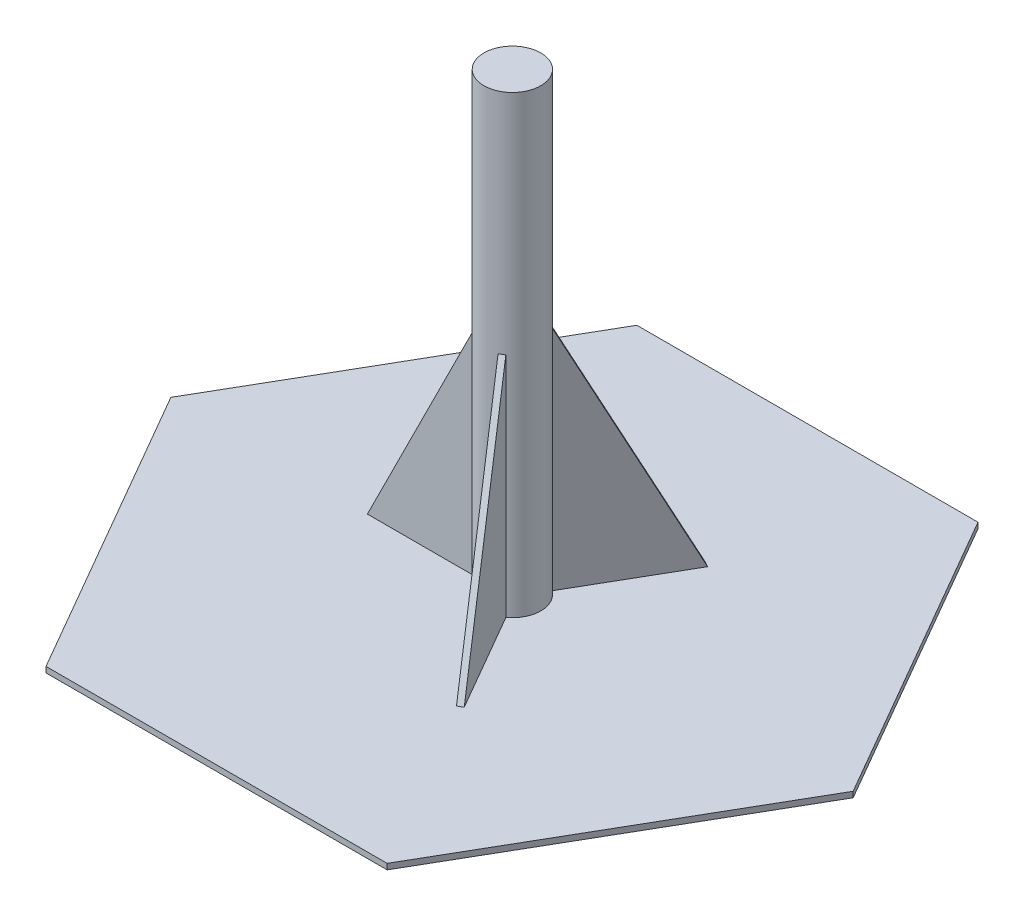
ISO-10303-21;
HEADER;
FILE_DESCRIPTION(('STEP AP214'),'2;1');
FILE_NAME('part.step','',(''),(''),'','','');
FILE_SCHEMA(('AUTOMOTIVE_DESIGN { 1 0 10303 214 1 1 1 1 }'));
ENDSEC;
DATA;
#1=APPLICATION_CONTEXT('core data for automotive mechanical design processes');
#2=APPLICATION_PROTOCOL_DEFINITION('international standard','automotive_design',2000,#1);
#3=PRODUCT_CONTEXT('',#1,'mechanical');
#4=PRODUCT('Part','Part','',(#3));
#5=PRODUCT_RELATED_PRODUCT_CATEGORY('part','',(#4));
#6=PRODUCT_DEFINITION_FORMATION('','',#4);
#7=PRODUCT_DEFINITION_CONTEXT('part definition',#1,'design');
#8=PRODUCT_DEFINITION('design','',#6,#7);
#9=PRODUCT_DEFINITION_SHAPE('','',#8);
#10=(LENGTH_UNIT() NAMED_UNIT(*) SI_UNIT(.MILLI.,.METRE.));
#11=(NAMED_UNIT(*) PLANE_ANGLE_UNIT() SI_UNIT($,.RADIAN.));
#12=(NAMED_UNIT(*) SI_UNIT($,.STERADIAN.) SOLID_ANGLE_UNIT());
#13=UNCERTAINTY_MEASURE_WITH_UNIT(LENGTH_MEASURE(1.E-05),#10,'distance_accuracy_value','');
#14=(GEOMETRIC_REPRESENTATION_CONTEXT(3) GLOBAL_UNCERTAINTY_ASSIGNED_CONTEXT((#13)) GLOBAL_UNIT_ASSIGNED_CONTEXT((#10,
#11,#12)) REPRESENTATION_CONTEXT('',''));
#15=CARTESIAN_POINT('',(0.,0.,0.));
#16=DIRECTION('',(0.,0.,1.));
#17=DIRECTION('',(1.,0.,0.));
#18=AXIS2_PLACEMENT_3D('',#15,#16,#17);
#19=CARTESIAN_POINT('',(5.25014773719376,104.14,-11.6335226280624));
#20=DIRECTION('',(-0.447213595499958,-0.447213595499958,0.774596669241483));
#21=DIRECTION('',(0.866025403784439,0.,0.5));
#22=AXIS2_PLACEMENT_3D('',#19,#20,#21);
#23=PLANE('',#22);
#24=DIRECTION('',(0.223606797749979,-0.894427190999916,-0.387298334620742));
#25=VECTOR('',#24,1.);
#26=CARTESIAN_POINT('',(7.44985226280624,104.14,-10.3635226280624));
#27=LINE('',#26,#25);
#28=CARTESIAN_POINT('',(7.44985226280624,104.14,-10.3635226280624));
#29=VERTEX_POINT('',#28);
#30=CARTESIAN_POINT('',(32.8498522628062,2.53999999999999,-54.3576131403118));
#31=VERTEX_POINT('',#30);
#32=EDGE_CURVE('E99',#29,#31,#27,.T.);
#33=ORIENTED_EDGE('',*,*,#32,.T.);
#34=DIRECTION('',(0.866025403784439,0.,0.5));
#35=VECTOR('',#34,1.);
#36=CARTESIAN_POINT('',(30.6501477371938,2.53999999999999,-55.6276131403118));
#37=LINE('',#36,#35);
#38=CARTESIAN_POINT('',(30.6501477371938,2.53999999999999,-55.6276131403118));
#39=VERTEX_POINT('',#38);
#40=EDGE_CURVE('E13',#39,#31,#37,.T.);
#41=ORIENTED_EDGE('',*,*,#40,.F.);
#42=DIRECTION('',(0.223606797749979,-0.894427190999916,-0.387298334620742));
#43=VECTOR('',#42,1.);
#44=CARTESIAN_POINT('',(5.25014773719376,104.14,-11.6335226280624));
#45=LINE('',#44,#43);
#46=CARTESIAN_POINT('',(5.25014773719376,104.14,-11.6335226280624));
#47=VERTEX_POINT('',#46);
#48=EDGE_CURVE('E92',#47,#39,#45,.T.);
#49=ORIENTED_EDGE('',*,*,#48,.F.);
#50=DIRECTION('',(0.866025403784439,0.,0.5));
#51=VECTOR('',#50,1.);
#52=CARTESIAN_POINT('',(5.25014773719376,104.14,-11.6335226280624));
#53=LINE('',#52,#51);
#54=EDGE_CURVE('E100',#47,#29,#53,.T.);
#55=ORIENTED_EDGE('',*,*,#54,.T.);
#56=EDGE_LOOP('',(#33,#41,#49,#55));
#57=FACE_BOUND('',#56,.T.);
#58=ADVANCED_FACE('F52',(#57),#23,.F.);
#59=CARTESIAN_POINT('',(5.25014773719376,2.53999999999999,-11.6335226280624));
#60=DIRECTION('',(0.,1.,0.));
#61=DIRECTION('',(0.,0.,1.));
#62=AXIS2_PLACEMENT_3D('',#59,#60,#61);
#63=PLANE('',#62);
#64=DIRECTION('',(-0.5,0.,0.866025403784439));
#65=VECTOR('',#64,1.);
#66=CARTESIAN_POINT('',(7.44985226280624,2.53999999999999,-10.3635226280624));
#67=LINE('',#66,#65);
#68=CARTESIAN_POINT('',(7.44985226280624,2.53999999999999,-10.3635226280624));
#69=VERTEX_POINT('',#68);
#70=EDGE_CURVE('E80',#31,#69,#67,.T.);
#71=ORIENTED_EDGE('',*,*,#70,.T.);
#72=DIRECTION('',(0.866025403784439,0.,0.5));
#73=VECTOR('',#72,1.);
#74=CARTESIAN_POINT('',(5.25014773719376,2.53999999999999,-11.6335226280624));
#75=LINE('',#74,#73);
#76=CARTESIAN_POINT('',(5.25014773719376,2.53999999999999,-11.6335226280624));
#77=VERTEX_POINT('',#76);
#78=EDGE_CURVE('E60',#77,#69,#75,.T.);
#79=ORIENTED_EDGE('',*,*,#78,.F.);
#80=DIRECTION('',(-0.5,0.,0.866025403784439));
#81=VECTOR('',#80,1.);
#82=CARTESIAN_POINT('',(5.25014773719376,2.53999999999999,-11.6335226280624));
#83=LINE('',#82,#81);
#84=EDGE_CURVE('E88',#39,#77,#83,.T.);
#85=ORIENTED_EDGE('',*,*,#84,.F.);
#86=ORIENTED_EDGE('',*,*,#40,.T.);
#87=EDGE_LOOP('',(#71,#79,#85,#86));
#88=FACE_BOUND('',#87,.T.);
#89=ADVANCED_FACE('F89',(#88),#63,.F.);
#90=CARTESIAN_POINT('',(5.25014773719376,2.53999999999999,-11.6335226280624));
#91=DIRECTION('',(0.5,0.,-0.866025403784439));
#92=DIRECTION('',(-0.866025403784439,0.,-0.5));
#93=AXIS2_PLACEMENT_3D('',#90,#91,#92);
#94=PLANE('',#93);
#95=DIRECTION('',(0.,1.,0.));
#96=VECTOR('',#95,1.);
#97=CARTESIAN_POINT('',(7.44985226280624,2.53999999999999,-10.3635226280624));
#98=LINE('',#97,#96);
#99=EDGE_CURVE('E85',#69,#29,#98,.T.);
#100=ORIENTED_EDGE('',*,*,#99,.T.);
#101=ORIENTED_EDGE('',*,*,#54,.F.);
#102=DIRECTION('',(0.,1.,0.));
#103=VECTOR('',#102,1.);
#104=CARTESIAN_POINT('',(5.25014773719376,2.53999999999999,-11.6335226280624));
#105=LINE('',#104,#103);
#106=EDGE_CURVE('E68',#77,#47,#105,.T.);
#107=ORIENTED_EDGE('',*,*,#106,.F.);
#108=ORIENTED_EDGE('',*,*,#78,.T.);
#109=EDGE_LOOP('',(#100,#101,#107,#108));
#110=FACE_BOUND('',#109,.T.);
#111=ADVANCED_FACE('F107',(#110),#94,.F.);
#112=CARTESIAN_POINT('',(-1.09985226280624,0.,-0.635));
#113=DIRECTION('',(0.866025403784439,0.,0.5));
#114=DIRECTION('',(0.5,0.,-0.866025403784439));
#115=AXIS2_PLACEMENT_3D('',#112,#113,#114);
#116=PLANE('',#115);
#117=ORIENTED_EDGE('',*,*,#48,.T.);
#118=ORIENTED_EDGE('',*,*,#84,.T.);
#119=ORIENTED_EDGE('',*,*,#106,.T.);
#120=EDGE_LOOP('',(#117,#118,#119));
#121=FACE_BOUND('',#120,.T.);
#122=ADVANCED_FACE('F95',(#121),#116,.F.);
#123=CARTESIAN_POINT('',(1.09985226280624,0.,0.635));
#124=DIRECTION('',(0.866025403784439,0.,0.5));
#125=DIRECTION('',(0.5,0.,-0.866025403784439));
#126=AXIS2_PLACEMENT_3D('',#123,#124,#125);
#127=PLANE('',#126);
#128=ORIENTED_EDGE('',*,*,#32,.F.);
#129=ORIENTED_EDGE('',*,*,#99,.F.);
#130=ORIENTED_EDGE('',*,*,#70,.F.);
#131=EDGE_LOOP('',(#128,#129,#130));
#132=FACE_BOUND('',#131,.T.);
#133=ADVANCED_FACE('F108',(#132),#127,.T.);
#134=CLOSED_SHELL('',(#58,#89,#111,#122,#133));
#135=MANIFOLD_SOLID_BREP('B2',#134);
#136=CARTESIAN_POINT('',(-12.7,104.14,1.27000000000001));
#137=DIRECTION('',(0.894427190999916,-0.447213595499958,0.));
#138=DIRECTION('',(0.447213595499958,0.894427190999916,0.));
#139=AXIS2_PLACEMENT_3D('',#136,#137,#138);
#140=PLANE('',#139);
#141=DIRECTION('',(-0.447213595499958,-0.894427190999916,0.));
#142=VECTOR('',#141,1.);
#143=CARTESIAN_POINT('',(-12.7,104.14,-1.26999999999999));
#144=LINE('',#143,#142);
#145=CARTESIAN_POINT('',(-12.7,104.14,-1.26999999999999));
#146=VERTEX_POINT('',#145);
#147=CARTESIAN_POINT('',(-63.5,2.53999999999999,-1.26999999999999));
#148=VERTEX_POINT('',#147);
#149=EDGE_CURVE('E206',#146,#148,#144,.T.);
#150=ORIENTED_EDGE('',*,*,#149,.T.);
#151=DIRECTION('',(0.,0.,-1.));
#152=VECTOR('',#151,1.);
#153=CARTESIAN_POINT('',(-63.5,2.53999999999999,1.27000000000001));
#154=LINE('',#153,#152);
#155=CARTESIAN_POINT('',(-63.5,2.53999999999999,1.27000000000001));
#156=VERTEX_POINT('',#155);
#157=EDGE_CURVE('E50',#156,#148,#154,.T.);
#158=ORIENTED_EDGE('',*,*,#157,.F.);
#159=DIRECTION('',(-0.447213595499958,-0.894427190999916,0.));
#160=VECTOR('',#159,1.);
#161=CARTESIAN_POINT('',(-12.7,104.14,1.27000000000001));
#162=LINE('',#161,#160);
#163=CARTESIAN_POINT('',(-12.7,104.14,1.27000000000001));
#164=VERTEX_POINT('',#163);
#165=EDGE_CURVE('E199',#164,#156,#162,.T.);
#166=ORIENTED_EDGE('',*,*,#165,.F.);
#167=DIRECTION('',(0.,0.,-1.));
#168=VECTOR('',#167,1.);
#169=CARTESIAN_POINT('',(-12.7,104.14,1.27000000000001));
#170=LINE('',#169,#168);
#171=EDGE_CURVE('E207',#164,#146,#170,.T.);
#172=ORIENTED_EDGE('',*,*,#171,.T.);
#173=EDGE_LOOP('',(#150,#158,#166,#172));
#174=FACE_BOUND('',#173,.T.);
#175=ADVANCED_FACE('F159',(#174),#140,.F.);
#176=CARTESIAN_POINT('',(-12.7,2.53999999999999,1.27000000000001));
#177=DIRECTION('',(0.,1.,0.));
#178=DIRECTION('',(0.,0.,1.));
#179=AXIS2_PLACEMENT_3D('',#176,#177,#178);
#180=PLANE('',#179);
#181=DIRECTION('',(1.,0.,0.));
#182=VECTOR('',#181,1.);
#183=CARTESIAN_POINT('',(-12.7,2.53999999999999,-1.26999999999999));
#184=LINE('',#183,#182);
#185=CARTESIAN_POINT('',(-12.7,2.53999999999999,-1.26999999999999));
#186=VERTEX_POINT('',#185);
#187=EDGE_CURVE('E187',#148,#186,#184,.T.);
#188=ORIENTED_EDGE('',*,*,#187,.T.);
#189=DIRECTION('',(0.,0.,-1.));
#190=VECTOR('',#189,1.);
#191=CARTESIAN_POINT('',(-12.7,2.53999999999999,1.27000000000001));
#192=LINE('',#191,#190);
#193=CARTESIAN_POINT('',(-12.7,2.53999999999999,1.27000000000001));
#194=VERTEX_POINT('',#193);
#195=EDGE_CURVE('E167',#194,#186,#192,.T.);
#196=ORIENTED_EDGE('',*,*,#195,.F.);
#197=DIRECTION('',(1.,0.,0.));
#198=VECTOR('',#197,1.);
#199=CARTESIAN_POINT('',(-12.7,2.53999999999999,1.27000000000001));
#200=LINE('',#199,#198);
#201=EDGE_CURVE('E195',#156,#194,#200,.T.);
#202=ORIENTED_EDGE('',*,*,#201,.F.);
#203=ORIENTED_EDGE('',*,*,#157,.T.);
#204=EDGE_LOOP('',(#188,#196,#202,#203));
#205=FACE_BOUND('',#204,.T.);
#206=ADVANCED_FACE('F196',(#205),#180,.F.);
#207=CARTESIAN_POINT('',(-12.7,2.53999999999999,1.27000000000001));
#208=DIRECTION('',(-1.,0.,0.));
#209=DIRECTION('',(0.,0.,1.));
#210=AXIS2_PLACEMENT_3D('',#207,#208,#209);
#211=PLANE('',#210);
#212=DIRECTION('',(0.,1.,0.));
#213=VECTOR('',#212,1.);
#214=CARTESIAN_POINT('',(-12.7,2.53999999999999,-1.26999999999999));
#215=LINE('',#214,#213);
#216=EDGE_CURVE('E192',#186,#146,#215,.T.);
#217=ORIENTED_EDGE('',*,*,#216,.T.);
#218=ORIENTED_EDGE('',*,*,#171,.F.);
#219=DIRECTION('',(0.,1.,0.));
#220=VECTOR('',#219,1.);
#221=CARTESIAN_POINT('',(-12.7,2.53999999999999,1.27000000000001));
#222=LINE('',#221,#220);
#223=EDGE_CURVE('E175',#194,#164,#222,.T.);
#224=ORIENTED_EDGE('',*,*,#223,.F.);
#225=ORIENTED_EDGE('',*,*,#195,.T.);
#226=EDGE_LOOP('',(#217,#218,#224,#225));
#227=FACE_BOUND('',#226,.T.);
#228=ADVANCED_FACE('F214',(#227),#211,.F.);
#229=CARTESIAN_POINT('',(0.,0.,1.27000000000001));
#230=DIRECTION('',(0.,0.,-1.));
#231=DIRECTION('',(-1.,0.,0.));
#232=AXIS2_PLACEMENT_3D('',#229,#230,#231);
#233=PLANE('',#232);
#234=ORIENTED_EDGE('',*,*,#165,.T.);
#235=ORIENTED_EDGE('',*,*,#201,.T.);
#236=ORIENTED_EDGE('',*,*,#223,.T.);
#237=EDGE_LOOP('',(#234,#235,#236));
#238=FACE_BOUND('',#237,.T.);
#239=ADVANCED_FACE('F202',(#238),#233,.F.);
#240=CARTESIAN_POINT('',(0.,0.,-1.26999999999999));
#241=DIRECTION('',(0.,0.,-1.));
#242=DIRECTION('',(-1.,0.,0.));
#243=AXIS2_PLACEMENT_3D('',#240,#241,#242);
#244=PLANE('',#243);
#245=ORIENTED_EDGE('',*,*,#149,.F.);
#246=ORIENTED_EDGE('',*,*,#216,.F.);
#247=ORIENTED_EDGE('',*,*,#187,.F.);
#248=EDGE_LOOP('',(#245,#246,#247));
#249=FACE_BOUND('',#248,.T.);
#250=ADVANCED_FACE('F215',(#249),#244,.T.);
#251=CLOSED_SHELL('',(#175,#206,#228,#239,#250));
#252=MANIFOLD_SOLID_BREP('B7',#251);
#253=CARTESIAN_POINT('',(7.44985226280624,104.14,10.3635226280624));
#254=DIRECTION('',(-0.447213595499958,-0.447213595499958,-0.774596669241483));
#255=DIRECTION('',(0.,0.866025403784439,-0.5));
#256=AXIS2_PLACEMENT_3D('',#253,#254,#255);
#257=PLANE('',#256);
#258=DIRECTION('',(0.223606797749979,-0.894427190999916,0.387298334620742));
#259=VECTOR('',#258,1.);
#260=CARTESIAN_POINT('',(5.25014773719376,104.14,11.6335226280624));
#261=LINE('',#260,#259);
#262=CARTESIAN_POINT('',(5.25014773719376,104.14,11.6335226280624));
#263=VERTEX_POINT('',#262);
#264=CARTESIAN_POINT('',(30.6501477371937,2.53999999999999,55.6276131403119));
#265=VERTEX_POINT('',#264);
#266=EDGE_CURVE('E312',#263,#265,#261,.T.);
#267=ORIENTED_EDGE('',*,*,#266,.T.);
#268=DIRECTION('',(-0.866025403784439,0.,0.5));
#269=VECTOR('',#268,1.);
#270=CARTESIAN_POINT('',(32.8498522628062,2.53999999999999,54.3576131403118));
#271=LINE('',#270,#269);
#272=CARTESIAN_POINT('',(32.8498522628062,2.53999999999999,54.3576131403118));
#273=VERTEX_POINT('',#272);
#274=EDGE_CURVE('E157',#273,#265,#271,.T.);
#275=ORIENTED_EDGE('',*,*,#274,.F.);
#276=DIRECTION('',(0.223606797749979,-0.894427190999916,0.387298334620742));
#277=VECTOR('',#276,1.);
#278=CARTESIAN_POINT('',(7.44985226280624,104.14,10.3635226280624));
#279=LINE('',#278,#277);
#280=CARTESIAN_POINT('',(7.44985226280624,104.14,10.3635226280624));
#281=VERTEX_POINT('',#280);
#282=EDGE_CURVE('E305',#281,#273,#279,.T.);
#283=ORIENTED_EDGE('',*,*,#282,.F.);
#284=DIRECTION('',(-0.866025403784439,0.,0.5));
#285=VECTOR('',#284,1.);
#286=CARTESIAN_POINT('',(7.44985226280624,104.14,10.3635226280624));
#287=LINE('',#286,#285);
#288=EDGE_CURVE('E313',#281,#263,#287,.T.);
#289=ORIENTED_EDGE('',*,*,#288,.T.);
#290=EDGE_LOOP('',(#267,#275,#283,#289));
#291=FACE_BOUND('',#290,.T.);
#292=ADVANCED_FACE('F265',(#291),#257,.F.);
#293=CARTESIAN_POINT('',(7.44985226280624,2.53999999999999,10.3635226280624));
#294=DIRECTION('',(0.,1.,0.));
#295=DIRECTION('',(0.,0.,1.));
#296=AXIS2_PLACEMENT_3D('',#293,#294,#295);
#297=PLANE('',#296);
#298=DIRECTION('',(-0.5,0.,-0.866025403784439));
#299=VECTOR('',#298,1.);
#300=CARTESIAN_POINT('',(5.25014773719376,2.53999999999999,11.6335226280624));
#301=LINE('',#300,#299);
#302=CARTESIAN_POINT('',(5.25014773719376,2.53999999999999,11.6335226280624));
#303=VERTEX_POINT('',#302);
#304=EDGE_CURVE('E293',#265,#303,#301,.T.);
#305=ORIENTED_EDGE('',*,*,#304,.T.);
#306=DIRECTION('',(-0.866025403784439,0.,0.5));
#307=VECTOR('',#306,1.);
#308=CARTESIAN_POINT('',(7.44985226280624,2.53999999999999,10.3635226280624));
#309=LINE('',#308,#307);
#310=CARTESIAN_POINT('',(7.44985226280624,2.53999999999999,10.3635226280624));
#311=VERTEX_POINT('',#310);
#312=EDGE_CURVE('E273',#311,#303,#309,.T.);
#313=ORIENTED_EDGE('',*,*,#312,.F.);
#314=DIRECTION('',(-0.5,0.,-0.866025403784439));
#315=VECTOR('',#314,1.);
#316=CARTESIAN_POINT('',(7.44985226280624,2.53999999999999,10.3635226280624));
#317=LINE('',#316,#315);
#318=EDGE_CURVE('E301',#273,#311,#317,.T.);
#319=ORIENTED_EDGE('',*,*,#318,.F.);
#320=ORIENTED_EDGE('',*,*,#274,.T.);
#321=EDGE_LOOP('',(#305,#313,#319,#320));
#322=FACE_BOUND('',#321,.T.);
#323=ADVANCED_FACE('F302',(#322),#297,.F.);
#324=CARTESIAN_POINT('',(7.44985226280624,2.53999999999999,10.3635226280624));
#325=DIRECTION('',(0.5,0.,0.866025403784439));
#326=DIRECTION('',(0.866025403784439,0.,-0.5));
#327=AXIS2_PLACEMENT_3D('',#324,#325,#326);
#328=PLANE('',#327);
#329=DIRECTION('',(0.,1.,0.));
#330=VECTOR('',#329,1.);
#331=CARTESIAN_POINT('',(5.25014773719376,2.53999999999999,11.6335226280624));
#332=LINE('',#331,#330);
#333=EDGE_CURVE('E298',#303,#263,#332,.T.);
#334=ORIENTED_EDGE('',*,*,#333,.T.);
#335=ORIENTED_EDGE('',*,*,#288,.F.);
#336=DIRECTION('',(0.,1.,0.));
#337=VECTOR('',#336,1.);
#338=CARTESIAN_POINT('',(7.44985226280624,2.53999999999999,10.3635226280624));
#339=LINE('',#338,#337);
#340=EDGE_CURVE('E281',#311,#281,#339,.T.);
#341=ORIENTED_EDGE('',*,*,#340,.F.);
#342=ORIENTED_EDGE('',*,*,#312,.T.);
#343=EDGE_LOOP('',(#334,#335,#341,#342));
#344=FACE_BOUND('',#343,.T.);
#345=ADVANCED_FACE('F320',(#344),#328,.F.);
#346=CARTESIAN_POINT('',(1.09985226280624,0.,-0.635));
#347=DIRECTION('',(-0.866025403784439,0.,0.5));
#348=DIRECTION('',(0.5,0.,0.866025403784439));
#349=AXIS2_PLACEMENT_3D('',#346,#347,#348);
#350=PLANE('',#349);
#351=ORIENTED_EDGE('',*,*,#282,.T.);
#352=ORIENTED_EDGE('',*,*,#318,.T.);
#353=ORIENTED_EDGE('',*,*,#340,.T.);
#354=EDGE_LOOP('',(#351,#352,#353));
#355=FACE_BOUND('',#354,.T.);
#356=ADVANCED_FACE('F308',(#355),#350,.F.);
#357=CARTESIAN_POINT('',(-1.09985226280624,0.,0.635));
#358=DIRECTION('',(-0.866025403784439,0.,0.5));
#359=DIRECTION('',(0.5,0.,0.866025403784439));
#360=AXIS2_PLACEMENT_3D('',#357,#358,#359);
#361=PLANE('',#360);
#362=ORIENTED_EDGE('',*,*,#266,.F.);
#363=ORIENTED_EDGE('',*,*,#333,.F.);
#364=ORIENTED_EDGE('',*,*,#304,.F.);
#365=EDGE_LOOP('',(#362,#363,#364));
#366=FACE_BOUND('',#365,.T.);
#367=ADVANCED_FACE('F321',(#366),#361,.T.);
#368=CLOSED_SHELL('',(#292,#323,#345,#356,#367));
#369=MANIFOLD_SOLID_BREP('B44',#368);
#370=CARTESIAN_POINT('',(-76.3645067291794,2.54,131.982271536748));
#371=DIRECTION('',(0.,0.,-1.));
#372=DIRECTION('',(-1.,0.,0.));
#373=AXIS2_PLACEMENT_3D('',#370,#371,#372);
#374=PLANE('',#373);
#375=DIRECTION('',(1.,0.,0.));
#376=VECTOR('',#375,1.);
#377=CARTESIAN_POINT('',(-76.3645067291794,0.,131.982271536748));
#378=LINE('',#377,#376);
#379=CARTESIAN_POINT('',(-76.3645067291794,0.,131.982271536748));
#380=VERTEX_POINT('',#379);
#381=CARTESIAN_POINT('',(76.0354932708207,0.,131.982271536748));
#382=VERTEX_POINT('',#381);
#383=EDGE_CURVE('E446',#380,#382,#378,.T.);
#384=ORIENTED_EDGE('',*,*,#383,.T.);
#385=DIRECTION('',(0.,-1.,0.));
#386=VECTOR('',#385,1.);
#387=CARTESIAN_POINT('',(76.0354932708207,2.54,131.982271536748));
#388=LINE('',#387,#386);
#389=CARTESIAN_POINT('',(76.0354932708207,2.54,131.982271536748));
#390=VERTEX_POINT('',#389);
#391=EDGE_CURVE('E263',#390,#382,#388,.T.);
#392=ORIENTED_EDGE('',*,*,#391,.F.);
#393=DIRECTION('',(1.,0.,0.));
#394=VECTOR('',#393,1.);
#395=CARTESIAN_POINT('',(-76.3645067291794,2.54,131.982271536748));
#396=LINE('',#395,#394);
#397=CARTESIAN_POINT('',(-76.3645067291794,2.54,131.982271536748));
#398=VERTEX_POINT('',#397);
#399=EDGE_CURVE('E457',#398,#390,#396,.T.);
#400=ORIENTED_EDGE('',*,*,#399,.F.);
#401=DIRECTION('',(0.,-1.,0.));
#402=VECTOR('',#401,1.);
#403=CARTESIAN_POINT('',(-76.3645067291794,2.54,131.982271536748));
#404=LINE('',#403,#402);
#405=EDGE_CURVE('E442',#398,#380,#404,.T.);
#406=ORIENTED_EDGE('',*,*,#405,.T.);
#407=EDGE_LOOP('',(#384,#392,#400,#406));
#408=FACE_BOUND('',#407,.T.);
#409=ADVANCED_FACE('F362',(#408),#374,.F.);
#410=CARTESIAN_POINT('',(76.0354932708207,2.54,131.982271536748));
#411=DIRECTION('',(-0.866025403784439,0.,-0.5));
#412=DIRECTION('',(-0.5,0.,0.866025403784439));
#413=AXIS2_PLACEMENT_3D('',#410,#411,#412);
#414=PLANE('',#413);
#415=DIRECTION('',(0.5,0.,-0.866025403784439));
#416=VECTOR('',#415,1.);
#417=CARTESIAN_POINT('',(76.0354932708207,0.,131.982271536748));
#418=LINE('',#417,#416);
#419=CARTESIAN_POINT('',(152.235493270821,0.,0.));
#420=VERTEX_POINT('',#419);
#421=EDGE_CURVE('E449',#382,#420,#418,.T.);
#422=ORIENTED_EDGE('',*,*,#421,.T.);
#423=DIRECTION('',(0.,-1.,0.));
#424=VECTOR('',#423,1.);
#425=CARTESIAN_POINT('',(152.235493270821,2.54,0.));
#426=LINE('',#425,#424);
#427=CARTESIAN_POINT('',(152.235493270821,2.54,0.));
#428=VERTEX_POINT('',#427);
#429=EDGE_CURVE('E370',#428,#420,#426,.T.);
#430=ORIENTED_EDGE('',*,*,#429,.F.);
#431=DIRECTION('',(0.5,0.,-0.866025403784439));
#432=VECTOR('',#431,1.);
#433=CARTESIAN_POINT('',(76.0354932708207,2.54,131.982271536748));
#434=LINE('',#433,#432);
#435=EDGE_CURVE('E415',#390,#428,#434,.T.);
#436=ORIENTED_EDGE('',*,*,#435,.F.);
#437=ORIENTED_EDGE('',*,*,#391,.T.);
#438=EDGE_LOOP('',(#422,#430,#436,#437));
#439=FACE_BOUND('',#438,.T.);
#440=ADVANCED_FACE('F482',(#439),#414,.F.);
#441=CARTESIAN_POINT('',(152.235493270821,2.54,0.));
#442=DIRECTION('',(-0.866025403784439,0.,0.5));
#443=DIRECTION('',(0.5,0.,0.866025403784439));
#444=AXIS2_PLACEMENT_3D('',#441,#442,#443);
#445=PLANE('',#444);
#446=DIRECTION('',(-0.5,0.,-0.866025403784439));
#447=VECTOR('',#446,1.);
#448=CARTESIAN_POINT('',(152.235493270821,0.,0.));
#449=LINE('',#448,#447);
#450=CARTESIAN_POINT('',(76.0354932708207,0.,-131.982271536748));
#451=VERTEX_POINT('',#450);
#452=EDGE_CURVE('E452',#420,#451,#449,.T.);
#453=ORIENTED_EDGE('',*,*,#452,.T.);
#454=DIRECTION('',(0.,-1.,0.));
#455=VECTOR('',#454,1.);
#456=CARTESIAN_POINT('',(76.0354932708207,2.54,-131.982271536748));
#457=LINE('',#456,#455);
#458=CARTESIAN_POINT('',(76.0354932708207,2.54,-131.982271536748));
#459=VERTEX_POINT('',#458);
#460=EDGE_CURVE('E437',#459,#451,#457,.T.);
#461=ORIENTED_EDGE('',*,*,#460,.F.);
#462=DIRECTION('',(-0.5,0.,-0.866025403784439));
#463=VECTOR('',#462,1.);
#464=CARTESIAN_POINT('',(152.235493270821,2.54,0.));
#465=LINE('',#464,#463);
#466=EDGE_CURVE('E428',#428,#459,#465,.T.);
#467=ORIENTED_EDGE('',*,*,#466,.F.);
#468=ORIENTED_EDGE('',*,*,#429,.T.);
#469=EDGE_LOOP('',(#453,#461,#467,#468));
#470=FACE_BOUND('',#469,.T.);
#471=ADVANCED_FACE('F463',(#470),#445,.F.);
#472=CARTESIAN_POINT('',(76.0354932708207,2.54,-131.982271536748));
#473=DIRECTION('',(0.,0.,1.));
#474=DIRECTION('',(1.,0.,0.));
#475=AXIS2_PLACEMENT_3D('',#472,#473,#474);
#476=PLANE('',#475);
#477=DIRECTION('',(-1.,0.,0.));
#478=VECTOR('',#477,1.);
#479=CARTESIAN_POINT('',(76.0354932708207,0.,-131.982271536748));
#480=LINE('',#479,#478);
#481=CARTESIAN_POINT('',(-76.3645067291793,0.,-131.982271536748));
#482=VERTEX_POINT('',#481);
#483=EDGE_CURVE('E436',#451,#482,#480,.T.);
#484=ORIENTED_EDGE('',*,*,#483,.T.);
#485=DIRECTION('',(0.,-1.,0.));
#486=VECTOR('',#485,1.);
#487=CARTESIAN_POINT('',(-76.3645067291793,2.54,-131.982271536748));
#488=LINE('',#487,#486);
#489=CARTESIAN_POINT('',(-76.3645067291793,2.54,-131.982271536748));
#490=VERTEX_POINT('',#489);
#491=EDGE_CURVE('E433',#490,#482,#488,.T.);
#492=ORIENTED_EDGE('',*,*,#491,.F.);
#493=DIRECTION('',(-1.,0.,0.));
#494=VECTOR('',#493,1.);
#495=CARTESIAN_POINT('',(76.0354932708207,2.54,-131.982271536748));
#496=LINE('',#495,#494);
#497=EDGE_CURVE('E422',#459,#490,#496,.T.);
#498=ORIENTED_EDGE('',*,*,#497,.F.);
#499=ORIENTED_EDGE('',*,*,#460,.T.);
#500=EDGE_LOOP('',(#484,#492,#498,#499));
#501=FACE_BOUND('',#500,.T.);
#502=ADVANCED_FACE('F434',(#501),#476,.F.);
#503=CARTESIAN_POINT('',(-76.3645067291793,2.54,-131.982271536748));
#504=DIRECTION('',(0.866025403784438,0.,0.5));
#505=DIRECTION('',(0.500000000000001,0.,-0.866025403784438));
#506=AXIS2_PLACEMENT_3D('',#503,#504,#505);
#507=PLANE('',#506);
#508=DIRECTION('',(-0.5,0.,0.866025403784438));
#509=VECTOR('',#508,1.);
#510=CARTESIAN_POINT('',(-76.3645067291793,0.,-131.982271536748));
#511=LINE('',#510,#509);
#512=CARTESIAN_POINT('',(-152.564506729179,0.,0.));
#513=VERTEX_POINT('',#512);
#514=EDGE_CURVE('E401',#482,#513,#511,.T.);
#515=ORIENTED_EDGE('',*,*,#514,.T.);
#516=DIRECTION('',(0.,-1.,0.));
#517=VECTOR('',#516,1.);
#518=CARTESIAN_POINT('',(-152.564506729179,2.54,0.));
#519=LINE('',#518,#517);
#520=CARTESIAN_POINT('',(-152.564506729179,2.54,0.));
#521=VERTEX_POINT('',#520);
#522=EDGE_CURVE('E438',#521,#513,#519,.T.);
#523=ORIENTED_EDGE('',*,*,#522,.F.);
#524=DIRECTION('',(-0.5,0.,0.866025403784438));
#525=VECTOR('',#524,1.);
#526=CARTESIAN_POINT('',(-76.3645067291793,2.54,-131.982271536748));
#527=LINE('',#526,#525);
#528=EDGE_CURVE('E426',#490,#521,#527,.T.);
#529=ORIENTED_EDGE('',*,*,#528,.F.);
#530=ORIENTED_EDGE('',*,*,#491,.T.);
#531=EDGE_LOOP('',(#515,#523,#529,#530));
#532=FACE_BOUND('',#531,.T.);
#533=ADVANCED_FACE('F440',(#532),#507,.F.);
#534=CARTESIAN_POINT('',(-152.564506729179,2.54,0.));
#535=DIRECTION('',(0.866025403784439,0.,-0.5));
#536=DIRECTION('',(-0.5,0.,-0.866025403784439));
#537=AXIS2_PLACEMENT_3D('',#534,#535,#536);
#538=PLANE('',#537);
#539=DIRECTION('',(0.5,0.,0.866025403784439));
#540=VECTOR('',#539,1.);
#541=CARTESIAN_POINT('',(-152.564506729179,0.,0.));
#542=LINE('',#541,#540);
#543=EDGE_CURVE('E407',#513,#380,#542,.T.);
#544=ORIENTED_EDGE('',*,*,#543,.T.);
#545=ORIENTED_EDGE('',*,*,#405,.F.);
#546=DIRECTION('',(0.5,0.,0.866025403784439));
#547=VECTOR('',#546,1.);
#548=CARTESIAN_POINT('',(-152.564506729179,2.54,0.));
#549=LINE('',#548,#547);
#550=EDGE_CURVE('E378',#521,#398,#549,.T.);
#551=ORIENTED_EDGE('',*,*,#550,.F.);
#552=ORIENTED_EDGE('',*,*,#522,.T.);
#553=EDGE_LOOP('',(#544,#545,#551,#552));
#554=FACE_BOUND('',#553,.T.);
#555=ADVANCED_FACE('F470',(#554),#538,.F.);
#556=CARTESIAN_POINT('',(0.,2.54,0.));
#557=DIRECTION('',(0.,1.,0.));
#558=DIRECTION('',(0.,0.,1.));
#559=AXIS2_PLACEMENT_3D('',#556,#557,#558);
#560=PLANE('',#559);
#561=CARTESIAN_POINT('',(0.,2.54,0.));
#562=DIRECTION('',(0.,1.,0.));
#563=DIRECTION('',(0.,0.,1.));
#564=AXIS2_PLACEMENT_3D('',#561,#562,#563);
#565=CIRCLE('',#564,12.7);
#566=CARTESIAN_POINT('',(0.,2.54,12.7));
#567=VERTEX_POINT('',#566);
#568=EDGE_CURVE('E543',#567,#567,#565,.T.);
#569=ORIENTED_EDGE('',*,*,#568,.F.);
#570=EDGE_LOOP('',(#569));
#571=FACE_BOUND('',#570,.T.);
#572=ORIENTED_EDGE('',*,*,#399,.T.);
#573=ORIENTED_EDGE('',*,*,#435,.T.);
#574=ORIENTED_EDGE('',*,*,#466,.T.);
#575=ORIENTED_EDGE('',*,*,#497,.T.);
#576=ORIENTED_EDGE('',*,*,#528,.T.);
#577=ORIENTED_EDGE('',*,*,#550,.T.);
#578=EDGE_LOOP('',(#572,#573,#574,#575,#576,#577));
#579=FACE_BOUND('',#578,.T.);
#580=ADVANCED_FACE('F424',(#571,#579),#560,.T.);
#581=CARTESIAN_POINT('',(0.,0.,0.));
#582=DIRECTION('',(0.,1.,0.));
#583=DIRECTION('',(0.,0.,1.));
#584=AXIS2_PLACEMENT_3D('',#581,#582,#583);
#585=PLANE('',#584);
#586=ORIENTED_EDGE('',*,*,#383,.F.);
#587=ORIENTED_EDGE('',*,*,#543,.F.);
#588=ORIENTED_EDGE('',*,*,#514,.F.);
#589=ORIENTED_EDGE('',*,*,#483,.F.);
#590=ORIENTED_EDGE('',*,*,#452,.F.);
#591=ORIENTED_EDGE('',*,*,#421,.F.);
#592=EDGE_LOOP('',(#586,#587,#588,#589,#590,#591));
#593=FACE_BOUND('',#592,.T.);
#594=ADVANCED_FACE('F466',(#593),#585,.F.);
#595=CARTESIAN_POINT('',(0.,205.74,0.));
#596=DIRECTION('',(0.,-1.,0.));
#597=DIRECTION('',(0.,0.,-1.));
#598=AXIS2_PLACEMENT_3D('',#595,#596,#597);
#599=CYLINDRICAL_SURFACE('',#598,12.7);
#600=CARTESIAN_POINT('',(0.,205.74,0.));
#601=DIRECTION('',(0.,1.,0.));
#602=DIRECTION('',(0.,0.,1.));
#603=AXIS2_PLACEMENT_3D('',#600,#601,#602);
#604=CIRCLE('',#603,12.7);
#605=CARTESIAN_POINT('',(0.,205.74,12.7));
#606=VERTEX_POINT('',#605);
#607=EDGE_CURVE('E450',#606,#606,#604,.T.);
#608=ORIENTED_EDGE('',*,*,#607,.F.);
#609=EDGE_LOOP('',(#608));
#610=FACE_BOUND('',#609,.T.);
#611=ORIENTED_EDGE('',*,*,#568,.T.);
#612=EDGE_LOOP('',(#611));
#613=FACE_BOUND('',#612,.T.);
#614=ADVANCED_FACE('F514',(#610,#613),#599,.T.);
#615=CARTESIAN_POINT('',(0.,205.74,0.));
#616=DIRECTION('',(0.,1.,0.));
#617=DIRECTION('',(0.,0.,1.));
#618=AXIS2_PLACEMENT_3D('',#615,#616,#617);
#619=PLANE('',#618);
#620=ORIENTED_EDGE('',*,*,#607,.T.);
#621=EDGE_LOOP('',(#620));
#622=FACE_BOUND('',#621,.T.);
#623=ADVANCED_FACE('F527',(#622),#619,.T.);
#624=CLOSED_SHELL('',(#409,#440,#471,#502,#533,#555,#580,#594,#614,#623));
#625=MANIFOLD_SOLID_BREP('B151',#624);
#626=ADVANCED_BREP_SHAPE_REPRESENTATION('',(#18,#135,#252,#369,#625),#14);
#627=SHAPE_DEFINITION_REPRESENTATION(#9,#626);
ENDSEC;
END-ISO-10303-21;
